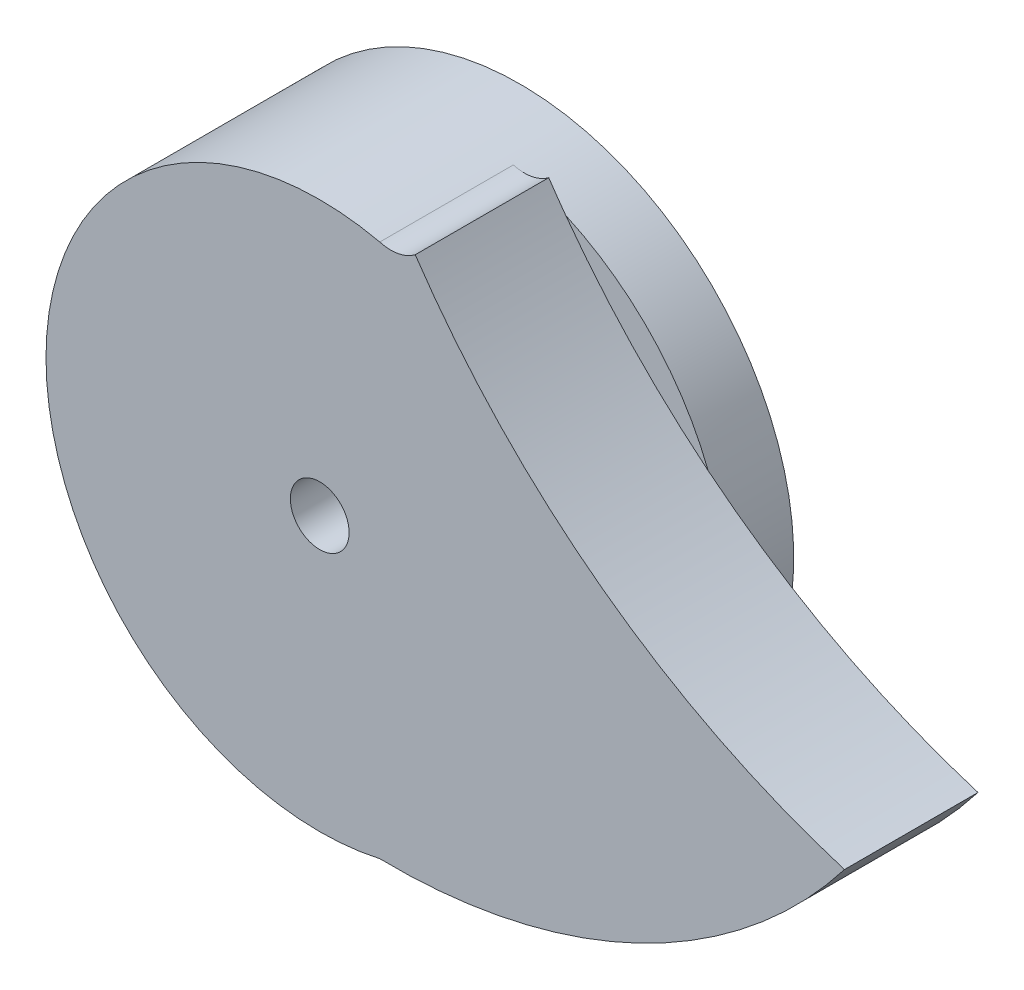
ISO-10303-21;
HEADER;
FILE_DESCRIPTION(('STEP AP214'),'2;1');
FILE_NAME('part.step','',(''),(''),'','','');
FILE_SCHEMA(('AUTOMOTIVE_DESIGN { 1 0 10303 214 1 1 1 1 }'));
ENDSEC;
DATA;
#1=APPLICATION_CONTEXT('core data for automotive mechanical design processes');
#2=APPLICATION_PROTOCOL_DEFINITION('international standard','automotive_design',2000,#1);
#3=PRODUCT_CONTEXT('',#1,'mechanical');
#4=PRODUCT('Part','Part','',(#3));
#5=PRODUCT_RELATED_PRODUCT_CATEGORY('part','',(#4));
#6=PRODUCT_DEFINITION_FORMATION('','',#4);
#7=PRODUCT_DEFINITION_CONTEXT('part definition',#1,'design');
#8=PRODUCT_DEFINITION('design','',#6,#7);
#9=PRODUCT_DEFINITION_SHAPE('','',#8);
#10=(LENGTH_UNIT() NAMED_UNIT(*) SI_UNIT(.MILLI.,.METRE.));
#11=(NAMED_UNIT(*) PLANE_ANGLE_UNIT() SI_UNIT($,.RADIAN.));
#12=(NAMED_UNIT(*) SI_UNIT($,.STERADIAN.) SOLID_ANGLE_UNIT());
#13=UNCERTAINTY_MEASURE_WITH_UNIT(LENGTH_MEASURE(1.E-05),#10,'distance_accuracy_value','');
#14=(GEOMETRIC_REPRESENTATION_CONTEXT(3) GLOBAL_UNCERTAINTY_ASSIGNED_CONTEXT((#13)) GLOBAL_UNIT_ASSIGNED_CONTEXT((#10,
#11,#12)) REPRESENTATION_CONTEXT('',''));
#15=CARTESIAN_POINT('',(0.,0.,0.));
#16=DIRECTION('',(0.,0.,1.));
#17=DIRECTION('',(1.,0.,0.));
#18=AXIS2_PLACEMENT_3D('',#15,#16,#17);
#19=CARTESIAN_POINT('',(23.9565577359449,17.971951377004,0.));
#20=DIRECTION('',(0.,0.,1.));
#21=DIRECTION('',(1.,0.,0.));
#22=AXIS2_PLACEMENT_3D('',#19,#20,#21);
#23=PLANE('',#22);
#24=CARTESIAN_POINT('',(-7.15305385044331,-20.5,0.));
#25=DIRECTION('',(0.,0.,-1.));
#26=DIRECTION('',(-1.,0.,0.));
#27=AXIS2_PLACEMENT_3D('',#24,#25,#26);
#28=CIRCLE('',#27,20.5);
#29=CARTESIAN_POINT('',(-2.35175868813592,-0.570184025826939,0.));
#30=VERTEX_POINT('',#29);
#31=CARTESIAN_POINT('',(1.27119264704385,-1.81091037665089,0.));
#32=VERTEX_POINT('',#31);
#33=EDGE_CURVE('E12',#30,#32,#28,.T.);
#34=ORIENTED_EDGE('',*,*,#33,.F.);
#35=CARTESIAN_POINT('',(-1.82270960047166,2.38279871419062,0.));
#36=DIRECTION('',(0.,0.,-1.));
#37=DIRECTION('',(-1.,0.,0.));
#38=AXIS2_PLACEMENT_3D('',#35,#36,#37);
#39=CIRCLE('',#38,3.);
#40=CARTESIAN_POINT('',(0.,0.,0.));
#41=VERTEX_POINT('',#40);
#42=EDGE_CURVE('E112',#41,#30,#39,.T.);
#43=ORIENTED_EDGE('',*,*,#42,.F.);
#44=CARTESIAN_POINT('',(49.7358250723615,33.5611040398175,0.));
#45=DIRECTION('',(0.,0.,-1.));
#46=DIRECTION('',(1.,0.,0.));
#47=AXIS2_PLACEMENT_3D('',#44,#45,#46);
#48=CIRCLE('',#47,60.);
#49=EDGE_CURVE('E143',#32,#41,#48,.T.);
#50=ORIENTED_EDGE('',*,*,#49,.F.);
#51=EDGE_LOOP('',(#34,#43,#50));
#52=FACE_BOUND('',#51,.T.);
#53=ADVANCED_FACE('F43',(#52),#23,.F.);
#54=CARTESIAN_POINT('',(11.9409089415702,-13.0387276623084,0.));
#55=VERTEX_POINT('',#54);
#56=CARTESIAN_POINT('',(-2.65305385044326,-40.5,0.));
#57=VERTEX_POINT('',#56);
#58=EDGE_CURVE('E55',#55,#57,#28,.T.);
#59=ORIENTED_EDGE('',*,*,#58,.F.);
#60=CARTESIAN_POINT('',(32.1468804611134,-23.8029005925514,0.));
#61=VERTEX_POINT('',#60);
#62=EDGE_CURVE('E114',#61,#55,#48,.T.);
#63=ORIENTED_EDGE('',*,*,#62,.F.);
#64=CARTESIAN_POINT('',(-1.82270960047166,2.38279871419062,0.));
#65=DIRECTION('',(0.,0.,1.));
#66=DIRECTION('',(-1.,0.,0.));
#67=AXIS2_PLACEMENT_3D('',#64,#65,#66);
#68=CIRCLE('',#67,42.8908369833843);
#69=EDGE_CURVE('E84',#57,#61,#68,.T.);
#70=ORIENTED_EDGE('',*,*,#69,.F.);
#71=EDGE_LOOP('',(#59,#63,#70));
#72=FACE_BOUND('',#71,.T.);
#73=ADVANCED_FACE('F159',(#72),#23,.F.);
#74=CARTESIAN_POINT('',(23.9565577359449,17.971951377004,10.));
#75=DIRECTION('',(0.,0.,1.));
#76=DIRECTION('',(1.,0.,0.));
#77=AXIS2_PLACEMENT_3D('',#74,#75,#76);
#78=PLANE('',#77);
#79=CARTESIAN_POINT('',(49.7358250723615,33.5611040398175,10.));
#80=DIRECTION('',(0.,0.,-1.));
#81=DIRECTION('',(1.,0.,0.));
#82=AXIS2_PLACEMENT_3D('',#79,#80,#81);
#83=CIRCLE('',#82,60.);
#84=CARTESIAN_POINT('',(32.1468804611134,-23.8029005925514,10.));
#85=VERTEX_POINT('',#84);
#86=CARTESIAN_POINT('',(0.,0.,10.));
#87=VERTEX_POINT('',#86);
#88=EDGE_CURVE('E144',#85,#87,#83,.T.);
#89=ORIENTED_EDGE('',*,*,#88,.T.);
#90=CARTESIAN_POINT('',(-1.82270960047166,2.38279871419062,10.));
#91=DIRECTION('',(0.,0.,-1.));
#92=DIRECTION('',(-1.,0.,0.));
#93=AXIS2_PLACEMENT_3D('',#90,#91,#92);
#94=CIRCLE('',#93,3.);
#95=CARTESIAN_POINT('',(-2.65305385044326,-0.500000000000005,10.));
#96=VERTEX_POINT('',#95);
#97=EDGE_CURVE('E92',#87,#96,#94,.T.);
#98=ORIENTED_EDGE('',*,*,#97,.T.);
#99=CARTESIAN_POINT('',(-7.15305385044331,-20.5,10.));
#100=DIRECTION('',(0.,0.,1.));
#101=DIRECTION('',(1.,0.,0.));
#102=AXIS2_PLACEMENT_3D('',#99,#100,#101);
#103=CIRCLE('',#102,20.5);
#104=CARTESIAN_POINT('',(-2.65305385044326,-40.5,10.));
#105=VERTEX_POINT('',#104);
#106=EDGE_CURVE('E119',#96,#105,#103,.T.);
#107=ORIENTED_EDGE('',*,*,#106,.T.);
#108=CARTESIAN_POINT('',(-1.82270960047166,2.38279871419062,10.));
#109=DIRECTION('',(0.,0.,1.));
#110=DIRECTION('',(-1.,0.,0.));
#111=AXIS2_PLACEMENT_3D('',#108,#109,#110);
#112=CIRCLE('',#111,42.8908369833843);
#113=EDGE_CURVE('E64',#105,#85,#112,.T.);
#114=ORIENTED_EDGE('',*,*,#113,.T.);
#115=EDGE_LOOP('',(#89,#98,#107,#114));
#116=FACE_BOUND('',#115,.T.);
#117=CARTESIAN_POINT('',(-7.15305385044331,-20.5,10.));
#118=DIRECTION('',(0.,0.,1.));
#119=DIRECTION('',(1.,0.,0.));
#120=AXIS2_PLACEMENT_3D('',#117,#118,#119);
#121=CIRCLE('',#120,2.2);
#122=CARTESIAN_POINT('',(-4.95305385044331,-20.5,10.));
#123=VERTEX_POINT('',#122);
#124=EDGE_CURVE('E140',#123,#123,#121,.T.);
#125=ORIENTED_EDGE('',*,*,#124,.F.);
#126=EDGE_LOOP('',(#125));
#127=FACE_BOUND('',#126,.T.);
#128=ADVANCED_FACE('F161',(#116,#127),#78,.T.);
#129=CARTESIAN_POINT('',(49.7358250723615,33.5611040398175,10.));
#130=DIRECTION('',(0.,0.,-1.));
#131=DIRECTION('',(-1.,0.,0.));
#132=AXIS2_PLACEMENT_3D('',#129,#130,#131);
#133=CYLINDRICAL_SURFACE('',#132,60.);
#134=ORIENTED_EDGE('',*,*,#62,.T.);
#135=EDGE_CURVE('E151',#55,#32,#48,.T.);
#136=ORIENTED_EDGE('',*,*,#135,.T.);
#137=ORIENTED_EDGE('',*,*,#49,.T.);
#138=DIRECTION('',(0.,0.,-1.));
#139=VECTOR('',#138,1.);
#140=CARTESIAN_POINT('',(0.,0.,10.));
#141=LINE('',#140,#139);
#142=EDGE_CURVE('E120',#87,#41,#141,.T.);
#143=ORIENTED_EDGE('',*,*,#142,.F.);
#144=ORIENTED_EDGE('',*,*,#88,.F.);
#145=DIRECTION('',(0.,0.,-1.));
#146=VECTOR('',#145,1.);
#147=CARTESIAN_POINT('',(32.1468804611134,-23.8029005925514,10.));
#148=LINE('',#147,#146);
#149=EDGE_CURVE('E123',#85,#61,#148,.T.);
#150=ORIENTED_EDGE('',*,*,#149,.T.);
#151=EDGE_LOOP('',(#134,#136,#137,#143,#144,#150));
#152=FACE_BOUND('',#151,.T.);
#153=ADVANCED_FACE('F45',(#152),#133,.F.);
#154=CARTESIAN_POINT('',(-1.82270960047166,2.38279871419062,10.));
#155=DIRECTION('',(0.,0.,-1.));
#156=DIRECTION('',(-1.,0.,0.));
#157=AXIS2_PLACEMENT_3D('',#154,#155,#156);
#158=CYLINDRICAL_SURFACE('',#157,3.);
#159=ORIENTED_EDGE('',*,*,#42,.T.);
#160=CARTESIAN_POINT('',(-1.82270960047166,2.38279871419062,0.));
#161=DIRECTION('',(0.,0.,-1.));
#162=DIRECTION('',(-0.176349695888088,-0.984327580005853,0.));
#163=AXIS2_PLACEMENT_3D('',#160,#161,#162);
#164=CIRCLE('',#163,3.);
#165=CARTESIAN_POINT('',(-2.65305385044326,-0.500000000000011,0.));
#166=VERTEX_POINT('',#165);
#167=EDGE_CURVE('E105',#30,#166,#164,.T.);
#168=ORIENTED_EDGE('',*,*,#167,.T.);
#169=DIRECTION('',(0.,0.,-1.));
#170=VECTOR('',#169,1.);
#171=CARTESIAN_POINT('',(-2.65305385044326,-0.500000000000005,10.));
#172=LINE('',#171,#170);
#173=EDGE_CURVE('E109',#96,#166,#172,.T.);
#174=ORIENTED_EDGE('',*,*,#173,.F.);
#175=ORIENTED_EDGE('',*,*,#97,.F.);
#176=ORIENTED_EDGE('',*,*,#142,.T.);
#177=EDGE_LOOP('',(#159,#168,#174,#175,#176));
#178=FACE_BOUND('',#177,.T.);
#179=ADVANCED_FACE('F108',(#178),#158,.F.);
#180=CARTESIAN_POINT('',(-7.15305385044331,-20.5,10.));
#181=DIRECTION('',(0.,0.,-1.));
#182=DIRECTION('',(-1.,0.,0.));
#183=AXIS2_PLACEMENT_3D('',#180,#181,#182);
#184=CYLINDRICAL_SURFACE('',#183,20.5);
#185=ORIENTED_EDGE('',*,*,#173,.T.);
#186=ORIENTED_EDGE('',*,*,#167,.F.);
#187=ORIENTED_EDGE('',*,*,#33,.T.);
#188=EDGE_CURVE('E133',#32,#55,#28,.T.);
#189=ORIENTED_EDGE('',*,*,#188,.T.);
#190=ORIENTED_EDGE('',*,*,#58,.T.);
#191=DIRECTION('',(0.,0.,-1.));
#192=VECTOR('',#191,1.);
#193=CARTESIAN_POINT('',(-2.65305385044326,-40.5,10.));
#194=LINE('',#193,#192);
#195=EDGE_CURVE('E121',#105,#57,#194,.T.);
#196=ORIENTED_EDGE('',*,*,#195,.F.);
#197=ORIENTED_EDGE('',*,*,#106,.F.);
#198=EDGE_LOOP('',(#185,#186,#187,#189,#190,#196,#197));
#199=FACE_BOUND('',#198,.T.);
#200=CARTESIAN_POINT('',(-7.15305385044331,-20.5,-5.));
#201=DIRECTION('',(0.,0.,-1.));
#202=DIRECTION('',(-1.,0.,0.));
#203=AXIS2_PLACEMENT_3D('',#200,#201,#202);
#204=CIRCLE('',#203,20.5);
#205=CARTESIAN_POINT('',(-27.6530538504433,-20.5,-5.));
#206=VERTEX_POINT('',#205);
#207=EDGE_CURVE('E137',#206,#206,#204,.T.);
#208=ORIENTED_EDGE('',*,*,#207,.F.);
#209=EDGE_LOOP('',(#208));
#210=FACE_BOUND('',#209,.T.);
#211=ADVANCED_FACE('F117',(#199,#210),#184,.T.);
#212=CARTESIAN_POINT('',(-1.82270960047166,2.38279871419062,10.));
#213=DIRECTION('',(0.,0.,-1.));
#214=DIRECTION('',(-1.,0.,0.));
#215=AXIS2_PLACEMENT_3D('',#212,#213,#214);
#216=CYLINDRICAL_SURFACE('',#215,42.8908369833843);
#217=ORIENTED_EDGE('',*,*,#69,.T.);
#218=ORIENTED_EDGE('',*,*,#149,.F.);
#219=ORIENTED_EDGE('',*,*,#113,.F.);
#220=ORIENTED_EDGE('',*,*,#195,.T.);
#221=EDGE_LOOP('',(#217,#218,#219,#220));
#222=FACE_BOUND('',#221,.T.);
#223=ADVANCED_FACE('F171',(#222),#216,.T.);
#224=CARTESIAN_POINT('',(-7.15305385044331,-20.5,10.));
#225=DIRECTION('',(0.,0.,-1.));
#226=DIRECTION('',(-1.,0.,0.));
#227=AXIS2_PLACEMENT_3D('',#224,#225,#226);
#228=CYLINDRICAL_SURFACE('',#227,2.2);
#229=ORIENTED_EDGE('',*,*,#124,.T.);
#230=EDGE_LOOP('',(#229));
#231=FACE_BOUND('',#230,.T.);
#232=CARTESIAN_POINT('',(-7.15305385044331,-20.5,-5.));
#233=DIRECTION('',(0.,0.,-1.));
#234=DIRECTION('',(-1.,0.,0.));
#235=AXIS2_PLACEMENT_3D('',#232,#233,#234);
#236=CIRCLE('',#235,2.2);
#237=CARTESIAN_POINT('',(-9.35305385044331,-20.5,-5.));
#238=VERTEX_POINT('',#237);
#239=EDGE_CURVE('E138',#238,#238,#236,.T.);
#240=ORIENTED_EDGE('',*,*,#239,.T.);
#241=EDGE_LOOP('',(#240));
#242=FACE_BOUND('',#241,.T.);
#243=ADVANCED_FACE('F173',(#231,#242),#228,.F.);
#244=CARTESIAN_POINT('',(-7.15305385044331,-20.5,0.));
#245=DIRECTION('',(0.,0.,-1.));
#246=DIRECTION('',(-1.,0.,0.));
#247=AXIS2_PLACEMENT_3D('',#244,#245,#246);
#248=PLANE('',#247);
#249=ORIENTED_EDGE('',*,*,#135,.F.);
#250=ORIENTED_EDGE('',*,*,#188,.F.);
#251=EDGE_LOOP('',(#249,#250));
#252=FACE_BOUND('',#251,.T.);
#253=ADVANCED_FACE('F208',(#252),#248,.F.);
#254=CARTESIAN_POINT('',(-7.15305385044331,-20.5,-5.));
#255=DIRECTION('',(0.,0.,-1.));
#256=DIRECTION('',(-1.,0.,0.));
#257=AXIS2_PLACEMENT_3D('',#254,#255,#256);
#258=PLANE('',#257);
#259=ORIENTED_EDGE('',*,*,#207,.T.);
#260=EDGE_LOOP('',(#259));
#261=FACE_BOUND('',#260,.T.);
#262=ORIENTED_EDGE('',*,*,#239,.F.);
#263=EDGE_LOOP('',(#262));
#264=FACE_BOUND('',#263,.T.);
#265=ADVANCED_FACE('F239',(#261,#264),#258,.T.);
#266=CLOSED_SHELL('',(#53,#73,#128,#153,#179,#211,#223,#243,#253,#265));
#267=MANIFOLD_SOLID_BREP('B2',#266);
#268=ADVANCED_BREP_SHAPE_REPRESENTATION('',(#18,#267),#14);
#269=SHAPE_DEFINITION_REPRESENTATION(#9,#268);
ENDSEC;
END-ISO-10303-21;
